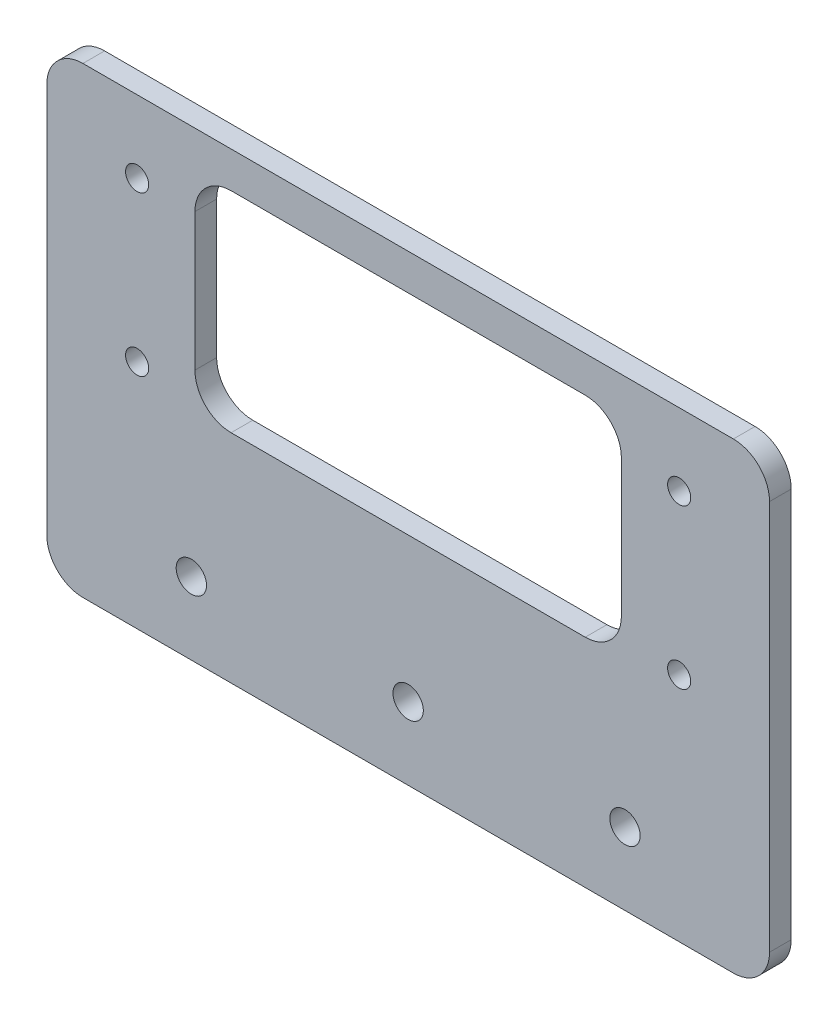
ISO-10303-21;
HEADER;
FILE_DESCRIPTION(('STEP AP214'),'2;1');
FILE_NAME('part.step','',(''),(''),'','','');
FILE_SCHEMA(('AUTOMOTIVE_DESIGN { 1 0 10303 214 1 1 1 1 }'));
ENDSEC;
DATA;
#1=APPLICATION_CONTEXT('core data for automotive mechanical design processes');
#2=APPLICATION_PROTOCOL_DEFINITION('international standard','automotive_design',2000,#1);
#3=PRODUCT_CONTEXT('',#1,'mechanical');
#4=PRODUCT('Part','Part','',(#3));
#5=PRODUCT_RELATED_PRODUCT_CATEGORY('part','',(#4));
#6=PRODUCT_DEFINITION_FORMATION('','',#4);
#7=PRODUCT_DEFINITION_CONTEXT('part definition',#1,'design');
#8=PRODUCT_DEFINITION('design','',#6,#7);
#9=PRODUCT_DEFINITION_SHAPE('','',#8);
#10=(LENGTH_UNIT() NAMED_UNIT(*) SI_UNIT(.MILLI.,.METRE.));
#11=(NAMED_UNIT(*) PLANE_ANGLE_UNIT() SI_UNIT($,.RADIAN.));
#12=(NAMED_UNIT(*) SI_UNIT($,.STERADIAN.) SOLID_ANGLE_UNIT());
#13=UNCERTAINTY_MEASURE_WITH_UNIT(LENGTH_MEASURE(1.E-05),#10,'distance_accuracy_value','');
#14=(GEOMETRIC_REPRESENTATION_CONTEXT(3) GLOBAL_UNCERTAINTY_ASSIGNED_CONTEXT((#13)) GLOBAL_UNIT_ASSIGNED_CONTEXT((#10,
#11,#12)) REPRESENTATION_CONTEXT('',''));
#15=CARTESIAN_POINT('',(0.,0.,0.));
#16=DIRECTION('',(0.,0.,1.));
#17=DIRECTION('',(1.,0.,0.));
#18=AXIS2_PLACEMENT_3D('',#15,#16,#17);
#19=CARTESIAN_POINT('',(0.,0.,3.));
#20=DIRECTION('',(0.,0.,-1.));
#21=DIRECTION('',(-1.,0.,0.));
#22=AXIS2_PLACEMENT_3D('',#19,#20,#21);
#23=PLANE('',#22);
#24=DIRECTION('',(-1.,0.,0.));
#25=VECTOR('',#24,1.);
#26=CARTESIAN_POINT('',(-29.5,27.,3.));
#27=LINE('',#26,#25);
#28=CARTESIAN_POINT('',(24.5,27.,3.));
#29=VERTEX_POINT('',#28);
#30=CARTESIAN_POINT('',(-24.5,27.,3.));
#31=VERTEX_POINT('',#30);
#32=EDGE_CURVE('E284',#29,#31,#27,.T.);
#33=ORIENTED_EDGE('',*,*,#32,.F.);
#34=CARTESIAN_POINT('',(24.5,22.,3.));
#35=DIRECTION('',(0.,0.,-1.));
#36=DIRECTION('',(-1.,0.,0.));
#37=AXIS2_PLACEMENT_3D('',#34,#35,#36);
#38=CIRCLE('',#37,5.);
#39=CARTESIAN_POINT('',(29.5,22.,3.));
#40=VERTEX_POINT('',#39);
#41=EDGE_CURVE('E177',#29,#40,#38,.T.);
#42=ORIENTED_EDGE('',*,*,#41,.T.);
#43=DIRECTION('',(0.,1.,0.));
#44=VECTOR('',#43,1.);
#45=CARTESIAN_POINT('',(29.5,27.,3.));
#46=LINE('',#45,#44);
#47=CARTESIAN_POINT('',(29.5,3.,3.));
#48=VERTEX_POINT('',#47);
#49=EDGE_CURVE('E156',#48,#40,#46,.T.);
#50=ORIENTED_EDGE('',*,*,#49,.F.);
#51=CARTESIAN_POINT('',(24.5,3.,3.));
#52=DIRECTION('',(0.,0.,-1.));
#53=DIRECTION('',(-1.,0.,0.));
#54=AXIS2_PLACEMENT_3D('',#51,#52,#53);
#55=CIRCLE('',#54,5.);
#56=CARTESIAN_POINT('',(24.5,-2.,3.));
#57=VERTEX_POINT('',#56);
#58=EDGE_CURVE('E261',#48,#57,#55,.T.);
#59=ORIENTED_EDGE('',*,*,#58,.T.);
#60=DIRECTION('',(1.,0.,0.));
#61=VECTOR('',#60,1.);
#62=CARTESIAN_POINT('',(-29.5,-2.,3.));
#63=LINE('',#62,#61);
#64=CARTESIAN_POINT('',(-24.5,-2.,3.));
#65=VERTEX_POINT('',#64);
#66=EDGE_CURVE('E289',#65,#57,#63,.T.);
#67=ORIENTED_EDGE('',*,*,#66,.F.);
#68=CARTESIAN_POINT('',(-24.5,3.,3.));
#69=DIRECTION('',(0.,0.,-1.));
#70=DIRECTION('',(-1.,0.,0.));
#71=AXIS2_PLACEMENT_3D('',#68,#69,#70);
#72=CIRCLE('',#71,5.);
#73=CARTESIAN_POINT('',(-29.5,3.,3.));
#74=VERTEX_POINT('',#73);
#75=EDGE_CURVE('E264',#65,#74,#72,.T.);
#76=ORIENTED_EDGE('',*,*,#75,.T.);
#77=DIRECTION('',(0.,-1.,0.));
#78=VECTOR('',#77,1.);
#79=CARTESIAN_POINT('',(-29.5,27.,3.));
#80=LINE('',#79,#78);
#81=CARTESIAN_POINT('',(-29.5,22.,3.));
#82=VERTEX_POINT('',#81);
#83=EDGE_CURVE('E285',#82,#74,#80,.T.);
#84=ORIENTED_EDGE('',*,*,#83,.F.);
#85=CARTESIAN_POINT('',(-24.5,22.,3.));
#86=DIRECTION('',(0.,0.,-1.));
#87=DIRECTION('',(-1.,0.,0.));
#88=AXIS2_PLACEMENT_3D('',#85,#86,#87);
#89=CIRCLE('',#88,5.);
#90=EDGE_CURVE('E268',#82,#31,#89,.T.);
#91=ORIENTED_EDGE('',*,*,#90,.T.);
#92=EDGE_LOOP('',(#33,#42,#50,#59,#67,#76,#84,#91));
#93=FACE_BOUND('',#92,.T.);
#94=DIRECTION('',(1.,0.,0.));
#95=VECTOR('',#94,1.);
#96=CARTESIAN_POINT('',(-50.,-32.,3.));
#97=LINE('',#96,#95);
#98=CARTESIAN_POINT('',(-45.,-32.,3.));
#99=VERTEX_POINT('',#98);
#100=CARTESIAN_POINT('',(45.,-32.,3.));
#101=VERTEX_POINT('',#100);
#102=EDGE_CURVE('E242',#99,#101,#97,.T.);
#103=ORIENTED_EDGE('',*,*,#102,.T.);
#104=CARTESIAN_POINT('',(45.,-27.,3.));
#105=DIRECTION('',(0.,0.,-1.));
#106=DIRECTION('',(-1.,0.,0.));
#107=AXIS2_PLACEMENT_3D('',#104,#105,#106);
#108=CIRCLE('',#107,5.);
#109=CARTESIAN_POINT('',(50.,-27.,3.));
#110=VERTEX_POINT('',#109);
#111=EDGE_CURVE('E205',#101,#110,#108,.F.);
#112=ORIENTED_EDGE('',*,*,#111,.T.);
#113=DIRECTION('',(0.,1.,0.));
#114=VECTOR('',#113,1.);
#115=CARTESIAN_POINT('',(50.,-32.,3.));
#116=LINE('',#115,#114);
#117=CARTESIAN_POINT('',(50.,27.,3.));
#118=VERTEX_POINT('',#117);
#119=EDGE_CURVE('E238',#110,#118,#116,.T.);
#120=ORIENTED_EDGE('',*,*,#119,.T.);
#121=CARTESIAN_POINT('',(45.,27.,3.));
#122=DIRECTION('',(0.,0.,-1.));
#123=DIRECTION('',(-1.,0.,0.));
#124=AXIS2_PLACEMENT_3D('',#121,#122,#123);
#125=CIRCLE('',#124,5.);
#126=CARTESIAN_POINT('',(45.,32.,3.));
#127=VERTEX_POINT('',#126);
#128=EDGE_CURVE('E200',#118,#127,#125,.F.);
#129=ORIENTED_EDGE('',*,*,#128,.T.);
#130=DIRECTION('',(-1.,0.,0.));
#131=VECTOR('',#130,1.);
#132=CARTESIAN_POINT('',(-50.,32.,3.));
#133=LINE('',#132,#131);
#134=CARTESIAN_POINT('',(-45.,32.,3.));
#135=VERTEX_POINT('',#134);
#136=EDGE_CURVE('E219',#127,#135,#133,.T.);
#137=ORIENTED_EDGE('',*,*,#136,.T.);
#138=CARTESIAN_POINT('',(-45.,27.,3.));
#139=DIRECTION('',(0.,0.,-1.));
#140=DIRECTION('',(-1.,0.,0.));
#141=AXIS2_PLACEMENT_3D('',#138,#139,#140);
#142=CIRCLE('',#141,5.);
#143=CARTESIAN_POINT('',(-50.,27.,3.));
#144=VERTEX_POINT('',#143);
#145=EDGE_CURVE('E56',#135,#144,#142,.F.);
#146=ORIENTED_EDGE('',*,*,#145,.T.);
#147=DIRECTION('',(0.,-1.,0.));
#148=VECTOR('',#147,1.);
#149=CARTESIAN_POINT('',(-50.,-32.,3.));
#150=LINE('',#149,#148);
#151=CARTESIAN_POINT('',(-50.,-27.,3.));
#152=VERTEX_POINT('',#151);
#153=EDGE_CURVE('E339',#144,#152,#150,.T.);
#154=ORIENTED_EDGE('',*,*,#153,.T.);
#155=CARTESIAN_POINT('',(-45.,-27.,3.));
#156=DIRECTION('',(0.,0.,-1.));
#157=DIRECTION('',(-1.,0.,0.));
#158=AXIS2_PLACEMENT_3D('',#155,#156,#157);
#159=CIRCLE('',#158,5.);
#160=EDGE_CURVE('E203',#152,#99,#159,.F.);
#161=ORIENTED_EDGE('',*,*,#160,.T.);
#162=EDGE_LOOP('',(#103,#112,#120,#129,#137,#146,#154,#161));
#163=FACE_BOUND('',#162,.T.);
#164=CARTESIAN_POINT('',(-37.5,0.,3.));
#165=DIRECTION('',(0.,0.,1.));
#166=DIRECTION('',(1.,0.,0.));
#167=AXIS2_PLACEMENT_3D('',#164,#165,#166);
#168=CIRCLE('',#167,1.6);
#169=CARTESIAN_POINT('',(-35.9,0.,3.));
#170=VERTEX_POINT('',#169);
#171=EDGE_CURVE('E232',#170,#170,#168,.T.);
#172=ORIENTED_EDGE('',*,*,#171,.F.);
#173=EDGE_LOOP('',(#172));
#174=FACE_BOUND('',#173,.T.);
#175=CARTESIAN_POINT('',(-37.5,22.,3.));
#176=DIRECTION('',(0.,0.,1.));
#177=DIRECTION('',(1.,0.,0.));
#178=AXIS2_PLACEMENT_3D('',#175,#176,#177);
#179=CIRCLE('',#178,1.6);
#180=CARTESIAN_POINT('',(-35.9,22.,3.));
#181=VERTEX_POINT('',#180);
#182=EDGE_CURVE('E326',#181,#181,#179,.T.);
#183=ORIENTED_EDGE('',*,*,#182,.F.);
#184=EDGE_LOOP('',(#183));
#185=FACE_BOUND('',#184,.T.);
#186=CARTESIAN_POINT('',(37.5,0.,3.));
#187=DIRECTION('',(0.,0.,1.));
#188=DIRECTION('',(-1.,0.,0.));
#189=AXIS2_PLACEMENT_3D('',#186,#187,#188);
#190=CIRCLE('',#189,1.6);
#191=CARTESIAN_POINT('',(35.9,0.,3.));
#192=VERTEX_POINT('',#191);
#193=EDGE_CURVE('E320',#192,#192,#190,.T.);
#194=ORIENTED_EDGE('',*,*,#193,.F.);
#195=EDGE_LOOP('',(#194));
#196=FACE_BOUND('',#195,.T.);
#197=CARTESIAN_POINT('',(37.5,22.,3.));
#198=DIRECTION('',(0.,0.,1.));
#199=DIRECTION('',(-1.,0.,0.));
#200=AXIS2_PLACEMENT_3D('',#197,#198,#199);
#201=CIRCLE('',#200,1.6);
#202=CARTESIAN_POINT('',(35.9,22.,3.));
#203=VERTEX_POINT('',#202);
#204=EDGE_CURVE('E314',#203,#203,#201,.T.);
#205=ORIENTED_EDGE('',*,*,#204,.F.);
#206=EDGE_LOOP('',(#205));
#207=FACE_BOUND('',#206,.T.);
#208=CARTESIAN_POINT('',(30.,-22.,3.));
#209=DIRECTION('',(0.,0.,1.));
#210=DIRECTION('',(-1.,0.,0.));
#211=AXIS2_PLACEMENT_3D('',#208,#209,#210);
#212=CIRCLE('',#211,2.1);
#213=CARTESIAN_POINT('',(27.9,-22.,3.));
#214=VERTEX_POINT('',#213);
#215=EDGE_CURVE('E308',#214,#214,#212,.T.);
#216=ORIENTED_EDGE('',*,*,#215,.F.);
#217=EDGE_LOOP('',(#216));
#218=FACE_BOUND('',#217,.T.);
#219=CARTESIAN_POINT('',(-30.,-22.,3.));
#220=DIRECTION('',(0.,0.,1.));
#221=DIRECTION('',(1.,0.,0.));
#222=AXIS2_PLACEMENT_3D('',#219,#220,#221);
#223=CIRCLE('',#222,2.1);
#224=CARTESIAN_POINT('',(-27.9,-22.,3.));
#225=VERTEX_POINT('',#224);
#226=EDGE_CURVE('E302',#225,#225,#223,.T.);
#227=ORIENTED_EDGE('',*,*,#226,.F.);
#228=EDGE_LOOP('',(#227));
#229=FACE_BOUND('',#228,.T.);
#230=CARTESIAN_POINT('',(0.,-22.,3.));
#231=DIRECTION('',(0.,0.,1.));
#232=DIRECTION('',(1.,0.,0.));
#233=AXIS2_PLACEMENT_3D('',#230,#231,#232);
#234=CIRCLE('',#233,2.1);
#235=CARTESIAN_POINT('',(2.10000000000001,-22.,3.));
#236=VERTEX_POINT('',#235);
#237=EDGE_CURVE('E296',#236,#236,#234,.T.);
#238=ORIENTED_EDGE('',*,*,#237,.F.);
#239=EDGE_LOOP('',(#238));
#240=FACE_BOUND('',#239,.T.);
#241=ADVANCED_FACE('F34',(#93,#163,#174,#185,#196,#207,#218,#229,#240),#23,.F.);
#242=CARTESIAN_POINT('',(0.,0.,0.));
#243=DIRECTION('',(0.,0.,-1.));
#244=DIRECTION('',(-1.,0.,0.));
#245=AXIS2_PLACEMENT_3D('',#242,#243,#244);
#246=PLANE('',#245);
#247=DIRECTION('',(0.,-1.,0.));
#248=VECTOR('',#247,1.);
#249=CARTESIAN_POINT('',(29.5,0.,0.));
#250=LINE('',#249,#248);
#251=CARTESIAN_POINT('',(29.5,22.,0.));
#252=VERTEX_POINT('',#251);
#253=CARTESIAN_POINT('',(29.5,3.,0.));
#254=VERTEX_POINT('',#253);
#255=EDGE_CURVE('E153',#252,#254,#250,.T.);
#256=ORIENTED_EDGE('',*,*,#255,.F.);
#257=CARTESIAN_POINT('',(24.5,22.,0.));
#258=DIRECTION('',(0.,0.,-1.));
#259=DIRECTION('',(-1.,0.,0.));
#260=AXIS2_PLACEMENT_3D('',#257,#258,#259);
#261=CIRCLE('',#260,5.);
#262=CARTESIAN_POINT('',(24.5,27.,0.));
#263=VERTEX_POINT('',#262);
#264=EDGE_CURVE('E165',#252,#263,#261,.F.);
#265=ORIENTED_EDGE('',*,*,#264,.T.);
#266=DIRECTION('',(1.,0.,0.));
#267=VECTOR('',#266,1.);
#268=CARTESIAN_POINT('',(0.,27.,0.));
#269=LINE('',#268,#267);
#270=CARTESIAN_POINT('',(-24.5,27.,0.));
#271=VERTEX_POINT('',#270);
#272=EDGE_CURVE('E239',#271,#263,#269,.T.);
#273=ORIENTED_EDGE('',*,*,#272,.F.);
#274=CARTESIAN_POINT('',(-24.5,22.,0.));
#275=DIRECTION('',(0.,0.,-1.));
#276=DIRECTION('',(-1.,0.,0.));
#277=AXIS2_PLACEMENT_3D('',#274,#275,#276);
#278=CIRCLE('',#277,5.);
#279=CARTESIAN_POINT('',(-29.5,22.,0.));
#280=VERTEX_POINT('',#279);
#281=EDGE_CURVE('E181',#271,#280,#278,.F.);
#282=ORIENTED_EDGE('',*,*,#281,.T.);
#283=DIRECTION('',(0.,1.,0.));
#284=VECTOR('',#283,1.);
#285=CARTESIAN_POINT('',(-29.5,0.,0.));
#286=LINE('',#285,#284);
#287=CARTESIAN_POINT('',(-29.5,3.,0.));
#288=VERTEX_POINT('',#287);
#289=EDGE_CURVE('E241',#288,#280,#286,.T.);
#290=ORIENTED_EDGE('',*,*,#289,.F.);
#291=CARTESIAN_POINT('',(-24.5,3.,0.));
#292=DIRECTION('',(0.,0.,-1.));
#293=DIRECTION('',(-1.,0.,0.));
#294=AXIS2_PLACEMENT_3D('',#291,#292,#293);
#295=CIRCLE('',#294,5.);
#296=CARTESIAN_POINT('',(-24.5,-2.,0.));
#297=VERTEX_POINT('',#296);
#298=EDGE_CURVE('E266',#288,#297,#295,.F.);
#299=ORIENTED_EDGE('',*,*,#298,.T.);
#300=DIRECTION('',(-1.,0.,0.));
#301=VECTOR('',#300,1.);
#302=CARTESIAN_POINT('',(0.,-2.,0.));
#303=LINE('',#302,#301);
#304=CARTESIAN_POINT('',(24.5,-2.,0.));
#305=VERTEX_POINT('',#304);
#306=EDGE_CURVE('E170',#305,#297,#303,.T.);
#307=ORIENTED_EDGE('',*,*,#306,.F.);
#308=CARTESIAN_POINT('',(24.5,3.,0.));
#309=DIRECTION('',(0.,0.,-1.));
#310=DIRECTION('',(-1.,0.,0.));
#311=AXIS2_PLACEMENT_3D('',#308,#309,#310);
#312=CIRCLE('',#311,5.);
#313=EDGE_CURVE('E169',#305,#254,#312,.F.);
#314=ORIENTED_EDGE('',*,*,#313,.T.);
#315=EDGE_LOOP('',(#256,#265,#273,#282,#290,#299,#307,#314));
#316=FACE_BOUND('',#315,.T.);
#317=CARTESIAN_POINT('',(-30.,-22.,0.));
#318=DIRECTION('',(0.,0.,1.));
#319=DIRECTION('',(1.,0.,0.));
#320=AXIS2_PLACEMENT_3D('',#317,#318,#319);
#321=CIRCLE('',#320,2.1);
#322=CARTESIAN_POINT('',(-27.9,-22.,0.));
#323=VERTEX_POINT('',#322);
#324=EDGE_CURVE('E299',#323,#323,#321,.T.);
#325=ORIENTED_EDGE('',*,*,#324,.T.);
#326=EDGE_LOOP('',(#325));
#327=FACE_BOUND('',#326,.T.);
#328=CARTESIAN_POINT('',(37.5,22.,0.));
#329=DIRECTION('',(0.,0.,1.));
#330=DIRECTION('',(-1.,0.,0.));
#331=AXIS2_PLACEMENT_3D('',#328,#329,#330);
#332=CIRCLE('',#331,1.6);
#333=CARTESIAN_POINT('',(35.9,22.,0.));
#334=VERTEX_POINT('',#333);
#335=EDGE_CURVE('E311',#334,#334,#332,.T.);
#336=ORIENTED_EDGE('',*,*,#335,.T.);
#337=EDGE_LOOP('',(#336));
#338=FACE_BOUND('',#337,.T.);
#339=CARTESIAN_POINT('',(-37.5,22.,0.));
#340=DIRECTION('',(0.,0.,1.));
#341=DIRECTION('',(1.,0.,0.));
#342=AXIS2_PLACEMENT_3D('',#339,#340,#341);
#343=CIRCLE('',#342,1.6);
#344=CARTESIAN_POINT('',(-35.9,22.,0.));
#345=VERTEX_POINT('',#344);
#346=EDGE_CURVE('E323',#345,#345,#343,.T.);
#347=ORIENTED_EDGE('',*,*,#346,.T.);
#348=EDGE_LOOP('',(#347));
#349=FACE_BOUND('',#348,.T.);
#350=DIRECTION('',(0.,1.,0.));
#351=VECTOR('',#350,1.);
#352=CARTESIAN_POINT('',(50.,-32.,0.));
#353=LINE('',#352,#351);
#354=CARTESIAN_POINT('',(50.,-27.,0.));
#355=VERTEX_POINT('',#354);
#356=CARTESIAN_POINT('',(50.,27.,0.));
#357=VERTEX_POINT('',#356);
#358=EDGE_CURVE('E228',#355,#357,#353,.T.);
#359=ORIENTED_EDGE('',*,*,#358,.F.);
#360=CARTESIAN_POINT('',(45.,-27.,0.));
#361=DIRECTION('',(0.,0.,-1.));
#362=DIRECTION('',(-1.,0.,0.));
#363=AXIS2_PLACEMENT_3D('',#360,#361,#362);
#364=CIRCLE('',#363,5.);
#365=CARTESIAN_POINT('',(45.,-32.,0.));
#366=VERTEX_POINT('',#365);
#367=EDGE_CURVE('E193',#355,#366,#364,.T.);
#368=ORIENTED_EDGE('',*,*,#367,.T.);
#369=DIRECTION('',(1.,0.,0.));
#370=VECTOR('',#369,1.);
#371=CARTESIAN_POINT('',(-50.,-32.,0.));
#372=LINE('',#371,#370);
#373=CARTESIAN_POINT('',(-45.,-32.,0.));
#374=VERTEX_POINT('',#373);
#375=EDGE_CURVE('E230',#374,#366,#372,.T.);
#376=ORIENTED_EDGE('',*,*,#375,.F.);
#377=CARTESIAN_POINT('',(-45.,-27.,0.));
#378=DIRECTION('',(0.,0.,-1.));
#379=DIRECTION('',(-1.,0.,0.));
#380=AXIS2_PLACEMENT_3D('',#377,#378,#379);
#381=CIRCLE('',#380,5.);
#382=CARTESIAN_POINT('',(-50.,-27.,0.));
#383=VERTEX_POINT('',#382);
#384=EDGE_CURVE('E191',#374,#383,#381,.T.);
#385=ORIENTED_EDGE('',*,*,#384,.T.);
#386=DIRECTION('',(0.,-1.,0.));
#387=VECTOR('',#386,1.);
#388=CARTESIAN_POINT('',(-50.,-32.,0.));
#389=LINE('',#388,#387);
#390=CARTESIAN_POINT('',(-50.,27.,0.));
#391=VERTEX_POINT('',#390);
#392=EDGE_CURVE('E227',#391,#383,#389,.T.);
#393=ORIENTED_EDGE('',*,*,#392,.F.);
#394=CARTESIAN_POINT('',(-45.,27.,0.));
#395=DIRECTION('',(0.,0.,-1.));
#396=DIRECTION('',(-1.,0.,0.));
#397=AXIS2_PLACEMENT_3D('',#394,#395,#396);
#398=CIRCLE('',#397,5.);
#399=CARTESIAN_POINT('',(-45.,32.,0.));
#400=VERTEX_POINT('',#399);
#401=EDGE_CURVE('E189',#391,#400,#398,.T.);
#402=ORIENTED_EDGE('',*,*,#401,.T.);
#403=DIRECTION('',(-1.,0.,0.));
#404=VECTOR('',#403,1.);
#405=CARTESIAN_POINT('',(-50.,32.,0.));
#406=LINE('',#405,#404);
#407=CARTESIAN_POINT('',(45.,32.,0.));
#408=VERTEX_POINT('',#407);
#409=EDGE_CURVE('E217',#408,#400,#406,.T.);
#410=ORIENTED_EDGE('',*,*,#409,.F.);
#411=CARTESIAN_POINT('',(45.,27.,0.));
#412=DIRECTION('',(0.,0.,-1.));
#413=DIRECTION('',(-1.,0.,0.));
#414=AXIS2_PLACEMENT_3D('',#411,#412,#413);
#415=CIRCLE('',#414,5.);
#416=EDGE_CURVE('E187',#408,#357,#415,.T.);
#417=ORIENTED_EDGE('',*,*,#416,.T.);
#418=EDGE_LOOP('',(#359,#368,#376,#385,#393,#402,#410,#417));
#419=FACE_BOUND('',#418,.T.);
#420=CARTESIAN_POINT('',(-37.5,0.,0.));
#421=DIRECTION('',(0.,0.,1.));
#422=DIRECTION('',(1.,0.,0.));
#423=AXIS2_PLACEMENT_3D('',#420,#421,#422);
#424=CIRCLE('',#423,1.6);
#425=CARTESIAN_POINT('',(-35.9,0.,0.));
#426=VERTEX_POINT('',#425);
#427=EDGE_CURVE('E329',#426,#426,#424,.T.);
#428=ORIENTED_EDGE('',*,*,#427,.T.);
#429=EDGE_LOOP('',(#428));
#430=FACE_BOUND('',#429,.T.);
#431=CARTESIAN_POINT('',(37.5,0.,0.));
#432=DIRECTION('',(0.,0.,1.));
#433=DIRECTION('',(-1.,0.,0.));
#434=AXIS2_PLACEMENT_3D('',#431,#432,#433);
#435=CIRCLE('',#434,1.6);
#436=CARTESIAN_POINT('',(35.9,0.,0.));
#437=VERTEX_POINT('',#436);
#438=EDGE_CURVE('E317',#437,#437,#435,.T.);
#439=ORIENTED_EDGE('',*,*,#438,.T.);
#440=EDGE_LOOP('',(#439));
#441=FACE_BOUND('',#440,.T.);
#442=CARTESIAN_POINT('',(30.,-22.,0.));
#443=DIRECTION('',(0.,0.,1.));
#444=DIRECTION('',(-1.,0.,0.));
#445=AXIS2_PLACEMENT_3D('',#442,#443,#444);
#446=CIRCLE('',#445,2.1);
#447=CARTESIAN_POINT('',(27.9,-22.,0.));
#448=VERTEX_POINT('',#447);
#449=EDGE_CURVE('E305',#448,#448,#446,.T.);
#450=ORIENTED_EDGE('',*,*,#449,.T.);
#451=EDGE_LOOP('',(#450));
#452=FACE_BOUND('',#451,.T.);
#453=CARTESIAN_POINT('',(0.,-22.,0.));
#454=DIRECTION('',(0.,0.,1.));
#455=DIRECTION('',(1.,0.,0.));
#456=AXIS2_PLACEMENT_3D('',#453,#454,#455);
#457=CIRCLE('',#456,2.1);
#458=CARTESIAN_POINT('',(2.10000000000001,-22.,0.));
#459=VERTEX_POINT('',#458);
#460=EDGE_CURVE('E295',#459,#459,#457,.T.);
#461=ORIENTED_EDGE('',*,*,#460,.T.);
#462=EDGE_LOOP('',(#461));
#463=FACE_BOUND('',#462,.T.);
#464=ADVANCED_FACE('F162',(#316,#327,#338,#349,#419,#430,#441,#452,#463),#246,.T.);
#465=CARTESIAN_POINT('',(50.,-32.,3.));
#466=DIRECTION('',(-1.,0.,0.));
#467=DIRECTION('',(0.,0.,1.));
#468=AXIS2_PLACEMENT_3D('',#465,#466,#467);
#469=PLANE('',#468);
#470=ORIENTED_EDGE('',*,*,#119,.F.);
#471=DIRECTION('',(0.,0.,-1.));
#472=VECTOR('',#471,1.);
#473=CARTESIAN_POINT('',(50.,-27.,3.));
#474=LINE('',#473,#472);
#475=EDGE_CURVE('E179',#110,#355,#474,.T.);
#476=ORIENTED_EDGE('',*,*,#475,.T.);
#477=ORIENTED_EDGE('',*,*,#358,.T.);
#478=DIRECTION('',(0.,0.,-1.));
#479=VECTOR('',#478,1.);
#480=CARTESIAN_POINT('',(50.,27.,3.));
#481=LINE('',#480,#479);
#482=EDGE_CURVE('E176',#357,#118,#481,.F.);
#483=ORIENTED_EDGE('',*,*,#482,.T.);
#484=EDGE_LOOP('',(#470,#476,#477,#483));
#485=FACE_BOUND('',#484,.T.);
#486=ADVANCED_FACE('F353',(#485),#469,.F.);
#487=CARTESIAN_POINT('',(-50.,32.,3.));
#488=DIRECTION('',(0.,-1.,0.));
#489=DIRECTION('',(0.,0.,-1.));
#490=AXIS2_PLACEMENT_3D('',#487,#488,#489);
#491=PLANE('',#490);
#492=ORIENTED_EDGE('',*,*,#409,.T.);
#493=DIRECTION('',(0.,0.,-1.));
#494=VECTOR('',#493,1.);
#495=CARTESIAN_POINT('',(-45.,32.,3.));
#496=LINE('',#495,#494);
#497=EDGE_CURVE('E11',#400,#135,#496,.F.);
#498=ORIENTED_EDGE('',*,*,#497,.T.);
#499=ORIENTED_EDGE('',*,*,#136,.F.);
#500=DIRECTION('',(0.,0.,-1.));
#501=VECTOR('',#500,1.);
#502=CARTESIAN_POINT('',(45.,32.,3.));
#503=LINE('',#502,#501);
#504=EDGE_CURVE('E42',#127,#408,#503,.T.);
#505=ORIENTED_EDGE('',*,*,#504,.T.);
#506=EDGE_LOOP('',(#492,#498,#499,#505));
#507=FACE_BOUND('',#506,.T.);
#508=ADVANCED_FACE('F216',(#507),#491,.F.);
#509=CARTESIAN_POINT('',(-50.,-32.,3.));
#510=DIRECTION('',(1.,0.,0.));
#511=DIRECTION('',(0.,0.,-1.));
#512=AXIS2_PLACEMENT_3D('',#509,#510,#511);
#513=PLANE('',#512);
#514=ORIENTED_EDGE('',*,*,#392,.T.);
#515=DIRECTION('',(0.,0.,-1.));
#516=VECTOR('',#515,1.);
#517=CARTESIAN_POINT('',(-50.,-27.,3.));
#518=LINE('',#517,#516);
#519=EDGE_CURVE('E49',#383,#152,#518,.F.);
#520=ORIENTED_EDGE('',*,*,#519,.T.);
#521=ORIENTED_EDGE('',*,*,#153,.F.);
#522=DIRECTION('',(0.,0.,-1.));
#523=VECTOR('',#522,1.);
#524=CARTESIAN_POINT('',(-50.,27.,3.));
#525=LINE('',#524,#523);
#526=EDGE_CURVE('E207',#144,#391,#525,.T.);
#527=ORIENTED_EDGE('',*,*,#526,.T.);
#528=EDGE_LOOP('',(#514,#520,#521,#527));
#529=FACE_BOUND('',#528,.T.);
#530=ADVANCED_FACE('F359',(#529),#513,.F.);
#531=CARTESIAN_POINT('',(-50.,-32.,3.));
#532=DIRECTION('',(0.,1.,0.));
#533=DIRECTION('',(0.,0.,1.));
#534=AXIS2_PLACEMENT_3D('',#531,#532,#533);
#535=PLANE('',#534);
#536=ORIENTED_EDGE('',*,*,#375,.T.);
#537=DIRECTION('',(0.,0.,-1.));
#538=VECTOR('',#537,1.);
#539=CARTESIAN_POINT('',(45.,-32.,3.));
#540=LINE('',#539,#538);
#541=EDGE_CURVE('E198',#366,#101,#540,.F.);
#542=ORIENTED_EDGE('',*,*,#541,.T.);
#543=ORIENTED_EDGE('',*,*,#102,.F.);
#544=DIRECTION('',(0.,0.,-1.));
#545=VECTOR('',#544,1.);
#546=CARTESIAN_POINT('',(-45.,-32.,3.));
#547=LINE('',#546,#545);
#548=EDGE_CURVE('E195',#99,#374,#547,.T.);
#549=ORIENTED_EDGE('',*,*,#548,.T.);
#550=EDGE_LOOP('',(#536,#542,#543,#549));
#551=FACE_BOUND('',#550,.T.);
#552=ADVANCED_FACE('F356',(#551),#535,.F.);
#553=CARTESIAN_POINT('',(-37.5,0.,3.));
#554=DIRECTION('',(0.,0.,-1.));
#555=DIRECTION('',(-1.,0.,0.));
#556=AXIS2_PLACEMENT_3D('',#553,#554,#555);
#557=CYLINDRICAL_SURFACE('',#556,1.6);
#558=ORIENTED_EDGE('',*,*,#171,.T.);
#559=EDGE_LOOP('',(#558));
#560=FACE_BOUND('',#559,.T.);
#561=ORIENTED_EDGE('',*,*,#427,.F.);
#562=EDGE_LOOP('',(#561));
#563=FACE_BOUND('',#562,.T.);
#564=ADVANCED_FACE('F374',(#560,#563),#557,.F.);
#565=CARTESIAN_POINT('',(-37.5,22.,3.));
#566=DIRECTION('',(0.,0.,-1.));
#567=DIRECTION('',(-1.,0.,0.));
#568=AXIS2_PLACEMENT_3D('',#565,#566,#567);
#569=CYLINDRICAL_SURFACE('',#568,1.6);
#570=ORIENTED_EDGE('',*,*,#182,.T.);
#571=EDGE_LOOP('',(#570));
#572=FACE_BOUND('',#571,.T.);
#573=ORIENTED_EDGE('',*,*,#346,.F.);
#574=EDGE_LOOP('',(#573));
#575=FACE_BOUND('',#574,.T.);
#576=ADVANCED_FACE('F516',(#572,#575),#569,.F.);
#577=CARTESIAN_POINT('',(37.5,0.,3.));
#578=DIRECTION('',(0.,0.,-1.));
#579=DIRECTION('',(-1.,0.,0.));
#580=AXIS2_PLACEMENT_3D('',#577,#578,#579);
#581=CYLINDRICAL_SURFACE('',#580,1.6);
#582=ORIENTED_EDGE('',*,*,#193,.T.);
#583=EDGE_LOOP('',(#582));
#584=FACE_BOUND('',#583,.T.);
#585=ORIENTED_EDGE('',*,*,#438,.F.);
#586=EDGE_LOOP('',(#585));
#587=FACE_BOUND('',#586,.T.);
#588=ADVANCED_FACE('F507',(#584,#587),#581,.F.);
#589=CARTESIAN_POINT('',(37.5,22.,3.));
#590=DIRECTION('',(0.,0.,-1.));
#591=DIRECTION('',(-1.,0.,0.));
#592=AXIS2_PLACEMENT_3D('',#589,#590,#591);
#593=CYLINDRICAL_SURFACE('',#592,1.6);
#594=ORIENTED_EDGE('',*,*,#204,.T.);
#595=EDGE_LOOP('',(#594));
#596=FACE_BOUND('',#595,.T.);
#597=ORIENTED_EDGE('',*,*,#335,.F.);
#598=EDGE_LOOP('',(#597));
#599=FACE_BOUND('',#598,.T.);
#600=ADVANCED_FACE('F498',(#596,#599),#593,.F.);
#601=CARTESIAN_POINT('',(30.,-22.,3.));
#602=DIRECTION('',(0.,0.,-1.));
#603=DIRECTION('',(-1.,0.,0.));
#604=AXIS2_PLACEMENT_3D('',#601,#602,#603);
#605=CYLINDRICAL_SURFACE('',#604,2.1);
#606=ORIENTED_EDGE('',*,*,#215,.T.);
#607=EDGE_LOOP('',(#606));
#608=FACE_BOUND('',#607,.T.);
#609=ORIENTED_EDGE('',*,*,#449,.F.);
#610=EDGE_LOOP('',(#609));
#611=FACE_BOUND('',#610,.T.);
#612=ADVANCED_FACE('F489',(#608,#611),#605,.F.);
#613=CARTESIAN_POINT('',(-30.,-22.,3.));
#614=DIRECTION('',(0.,0.,-1.));
#615=DIRECTION('',(-1.,0.,0.));
#616=AXIS2_PLACEMENT_3D('',#613,#614,#615);
#617=CYLINDRICAL_SURFACE('',#616,2.1);
#618=ORIENTED_EDGE('',*,*,#226,.T.);
#619=EDGE_LOOP('',(#618));
#620=FACE_BOUND('',#619,.T.);
#621=ORIENTED_EDGE('',*,*,#324,.F.);
#622=EDGE_LOOP('',(#621));
#623=FACE_BOUND('',#622,.T.);
#624=ADVANCED_FACE('F480',(#620,#623),#617,.F.);
#625=CARTESIAN_POINT('',(0.,-22.,3.));
#626=DIRECTION('',(0.,0.,-1.));
#627=DIRECTION('',(-1.,0.,0.));
#628=AXIS2_PLACEMENT_3D('',#625,#626,#627);
#629=CYLINDRICAL_SURFACE('',#628,2.1);
#630=ORIENTED_EDGE('',*,*,#237,.T.);
#631=EDGE_LOOP('',(#630));
#632=FACE_BOUND('',#631,.T.);
#633=ORIENTED_EDGE('',*,*,#460,.F.);
#634=EDGE_LOOP('',(#633));
#635=FACE_BOUND('',#634,.T.);
#636=ADVANCED_FACE('F472',(#632,#635),#629,.F.);
#637=CARTESIAN_POINT('',(29.5,27.,-7.));
#638=DIRECTION('',(1.,0.,0.));
#639=DIRECTION('',(0.,1.,0.));
#640=AXIS2_PLACEMENT_3D('',#637,#638,#639);
#641=PLANE('',#640);
#642=ORIENTED_EDGE('',*,*,#255,.T.);
#643=DIRECTION('',(0.,0.,1.));
#644=VECTOR('',#643,1.);
#645=CARTESIAN_POINT('',(29.5,3.,3.));
#646=LINE('',#645,#644);
#647=EDGE_CURVE('E159',#254,#48,#646,.T.);
#648=ORIENTED_EDGE('',*,*,#647,.T.);
#649=ORIENTED_EDGE('',*,*,#49,.T.);
#650=DIRECTION('',(0.,0.,1.));
#651=VECTOR('',#650,1.);
#652=CARTESIAN_POINT('',(29.5,22.,0.));
#653=LINE('',#652,#651);
#654=EDGE_CURVE('E149',#40,#252,#653,.F.);
#655=ORIENTED_EDGE('',*,*,#654,.T.);
#656=EDGE_LOOP('',(#642,#648,#649,#655));
#657=FACE_BOUND('',#656,.T.);
#658=ADVANCED_FACE('F151',(#657),#641,.F.);
#659=CARTESIAN_POINT('',(-29.5,-2.,-7.));
#660=DIRECTION('',(0.,-1.,0.));
#661=DIRECTION('',(0.,0.,-1.));
#662=AXIS2_PLACEMENT_3D('',#659,#660,#661);
#663=PLANE('',#662);
#664=ORIENTED_EDGE('',*,*,#66,.T.);
#665=DIRECTION('',(0.,0.,1.));
#666=VECTOR('',#665,1.);
#667=CARTESIAN_POINT('',(24.5,-2.,0.));
#668=LINE('',#667,#666);
#669=EDGE_CURVE('E251',#57,#305,#668,.F.);
#670=ORIENTED_EDGE('',*,*,#669,.T.);
#671=ORIENTED_EDGE('',*,*,#306,.T.);
#672=DIRECTION('',(0.,0.,1.));
#673=VECTOR('',#672,1.);
#674=CARTESIAN_POINT('',(-24.5,-2.,3.));
#675=LINE('',#674,#673);
#676=EDGE_CURVE('E248',#297,#65,#675,.T.);
#677=ORIENTED_EDGE('',*,*,#676,.T.);
#678=EDGE_LOOP('',(#664,#670,#671,#677));
#679=FACE_BOUND('',#678,.T.);
#680=ADVANCED_FACE('F456',(#679),#663,.F.);
#681=CARTESIAN_POINT('',(-29.5,27.,-7.));
#682=DIRECTION('',(-1.,0.,0.));
#683=DIRECTION('',(0.,0.,1.));
#684=AXIS2_PLACEMENT_3D('',#681,#682,#683);
#685=PLANE('',#684);
#686=ORIENTED_EDGE('',*,*,#83,.T.);
#687=DIRECTION('',(0.,0.,1.));
#688=VECTOR('',#687,1.);
#689=CARTESIAN_POINT('',(-29.5,3.,0.));
#690=LINE('',#689,#688);
#691=EDGE_CURVE('E256',#74,#288,#690,.F.);
#692=ORIENTED_EDGE('',*,*,#691,.T.);
#693=ORIENTED_EDGE('',*,*,#289,.T.);
#694=DIRECTION('',(0.,0.,1.));
#695=VECTOR('',#694,1.);
#696=CARTESIAN_POINT('',(-29.5,22.,3.));
#697=LINE('',#696,#695);
#698=EDGE_CURVE('E253',#280,#82,#697,.T.);
#699=ORIENTED_EDGE('',*,*,#698,.T.);
#700=EDGE_LOOP('',(#686,#692,#693,#699));
#701=FACE_BOUND('',#700,.T.);
#702=ADVANCED_FACE('F277',(#701),#685,.F.);
#703=CARTESIAN_POINT('',(-29.5,27.,-7.));
#704=DIRECTION('',(0.,1.,0.));
#705=DIRECTION('',(0.,0.,1.));
#706=AXIS2_PLACEMENT_3D('',#703,#704,#705);
#707=PLANE('',#706);
#708=ORIENTED_EDGE('',*,*,#32,.T.);
#709=DIRECTION('',(0.,0.,1.));
#710=VECTOR('',#709,1.);
#711=CARTESIAN_POINT('',(-24.5,27.,0.));
#712=LINE('',#711,#710);
#713=EDGE_CURVE('E259',#31,#271,#712,.F.);
#714=ORIENTED_EDGE('',*,*,#713,.T.);
#715=ORIENTED_EDGE('',*,*,#272,.T.);
#716=DIRECTION('',(0.,0.,1.));
#717=VECTOR('',#716,1.);
#718=CARTESIAN_POINT('',(24.5,27.,3.));
#719=LINE('',#718,#717);
#720=EDGE_CURVE('E175',#263,#29,#719,.T.);
#721=ORIENTED_EDGE('',*,*,#720,.T.);
#722=EDGE_LOOP('',(#708,#714,#715,#721));
#723=FACE_BOUND('',#722,.T.);
#724=ADVANCED_FACE('F287',(#723),#707,.F.);
#725=CARTESIAN_POINT('',(24.5,3.,-7.));
#726=DIRECTION('',(0.,0.,-1.));
#727=DIRECTION('',(-1.,0.,0.));
#728=AXIS2_PLACEMENT_3D('',#725,#726,#727);
#729=CYLINDRICAL_SURFACE('',#728,5.);
#730=ORIENTED_EDGE('',*,*,#313,.F.);
#731=ORIENTED_EDGE('',*,*,#669,.F.);
#732=ORIENTED_EDGE('',*,*,#58,.F.);
#733=ORIENTED_EDGE('',*,*,#647,.F.);
#734=EDGE_LOOP('',(#730,#731,#732,#733));
#735=FACE_BOUND('',#734,.T.);
#736=ADVANCED_FACE('F385',(#735),#729,.F.);
#737=CARTESIAN_POINT('',(-24.5,3.,-7.));
#738=DIRECTION('',(0.,0.,-1.));
#739=DIRECTION('',(-1.,0.,0.));
#740=AXIS2_PLACEMENT_3D('',#737,#738,#739);
#741=CYLINDRICAL_SURFACE('',#740,5.);
#742=ORIENTED_EDGE('',*,*,#298,.F.);
#743=ORIENTED_EDGE('',*,*,#691,.F.);
#744=ORIENTED_EDGE('',*,*,#75,.F.);
#745=ORIENTED_EDGE('',*,*,#676,.F.);
#746=EDGE_LOOP('',(#742,#743,#744,#745));
#747=FACE_BOUND('',#746,.T.);
#748=ADVANCED_FACE('F388',(#747),#741,.F.);
#749=CARTESIAN_POINT('',(-24.5,22.,-7.));
#750=DIRECTION('',(0.,0.,-1.));
#751=DIRECTION('',(-1.,0.,0.));
#752=AXIS2_PLACEMENT_3D('',#749,#750,#751);
#753=CYLINDRICAL_SURFACE('',#752,5.);
#754=ORIENTED_EDGE('',*,*,#281,.F.);
#755=ORIENTED_EDGE('',*,*,#713,.F.);
#756=ORIENTED_EDGE('',*,*,#90,.F.);
#757=ORIENTED_EDGE('',*,*,#698,.F.);
#758=EDGE_LOOP('',(#754,#755,#756,#757));
#759=FACE_BOUND('',#758,.T.);
#760=ADVANCED_FACE('F280',(#759),#753,.F.);
#761=CARTESIAN_POINT('',(24.5,22.,-7.));
#762=DIRECTION('',(0.,0.,-1.));
#763=DIRECTION('',(-1.,0.,0.));
#764=AXIS2_PLACEMENT_3D('',#761,#762,#763);
#765=CYLINDRICAL_SURFACE('',#764,5.);
#766=ORIENTED_EDGE('',*,*,#264,.F.);
#767=ORIENTED_EDGE('',*,*,#654,.F.);
#768=ORIENTED_EDGE('',*,*,#41,.F.);
#769=ORIENTED_EDGE('',*,*,#720,.F.);
#770=EDGE_LOOP('',(#766,#767,#768,#769));
#771=FACE_BOUND('',#770,.T.);
#772=ADVANCED_FACE('F173',(#771),#765,.F.);
#773=CARTESIAN_POINT('',(45.,-27.,3.));
#774=DIRECTION('',(0.,0.,-1.));
#775=DIRECTION('',(-1.,0.,0.));
#776=AXIS2_PLACEMENT_3D('',#773,#774,#775);
#777=CYLINDRICAL_SURFACE('',#776,5.);
#778=ORIENTED_EDGE('',*,*,#111,.F.);
#779=ORIENTED_EDGE('',*,*,#541,.F.);
#780=ORIENTED_EDGE('',*,*,#367,.F.);
#781=ORIENTED_EDGE('',*,*,#475,.F.);
#782=EDGE_LOOP('',(#778,#779,#780,#781));
#783=FACE_BOUND('',#782,.T.);
#784=ADVANCED_FACE('F351',(#783),#777,.T.);
#785=CARTESIAN_POINT('',(-45.,-27.,3.));
#786=DIRECTION('',(0.,0.,-1.));
#787=DIRECTION('',(-1.,0.,0.));
#788=AXIS2_PLACEMENT_3D('',#785,#786,#787);
#789=CYLINDRICAL_SURFACE('',#788,5.);
#790=ORIENTED_EDGE('',*,*,#160,.F.);
#791=ORIENTED_EDGE('',*,*,#519,.F.);
#792=ORIENTED_EDGE('',*,*,#384,.F.);
#793=ORIENTED_EDGE('',*,*,#548,.F.);
#794=EDGE_LOOP('',(#790,#791,#792,#793));
#795=FACE_BOUND('',#794,.T.);
#796=ADVANCED_FACE('F358',(#795),#789,.T.);
#797=CARTESIAN_POINT('',(-45.,27.,3.));
#798=DIRECTION('',(0.,0.,-1.));
#799=DIRECTION('',(-1.,0.,0.));
#800=AXIS2_PLACEMENT_3D('',#797,#798,#799);
#801=CYLINDRICAL_SURFACE('',#800,5.);
#802=ORIENTED_EDGE('',*,*,#145,.F.);
#803=ORIENTED_EDGE('',*,*,#497,.F.);
#804=ORIENTED_EDGE('',*,*,#401,.F.);
#805=ORIENTED_EDGE('',*,*,#526,.F.);
#806=EDGE_LOOP('',(#802,#803,#804,#805));
#807=FACE_BOUND('',#806,.T.);
#808=ADVANCED_FACE('F362',(#807),#801,.T.);
#809=CARTESIAN_POINT('',(45.,27.,3.));
#810=DIRECTION('',(0.,0.,-1.));
#811=DIRECTION('',(-1.,0.,0.));
#812=AXIS2_PLACEMENT_3D('',#809,#810,#811);
#813=CYLINDRICAL_SURFACE('',#812,5.);
#814=ORIENTED_EDGE('',*,*,#128,.F.);
#815=ORIENTED_EDGE('',*,*,#482,.F.);
#816=ORIENTED_EDGE('',*,*,#416,.F.);
#817=ORIENTED_EDGE('',*,*,#504,.F.);
#818=EDGE_LOOP('',(#814,#815,#816,#817));
#819=FACE_BOUND('',#818,.T.);
#820=ADVANCED_FACE('F36',(#819),#813,.T.);
#821=CLOSED_SHELL('',(#241,#464,#486,#508,#530,#552,#564,#576,#588,#600,#612,#624,#636,#658,
#680,#702,#724,#736,#748,#760,#772,#784,#796,#808,#820));
#822=MANIFOLD_SOLID_BREP('B2',#821);
#823=ADVANCED_BREP_SHAPE_REPRESENTATION('',(#18,#822),#14);
#824=SHAPE_DEFINITION_REPRESENTATION(#9,#823);
ENDSEC;
END-ISO-10303-21;
